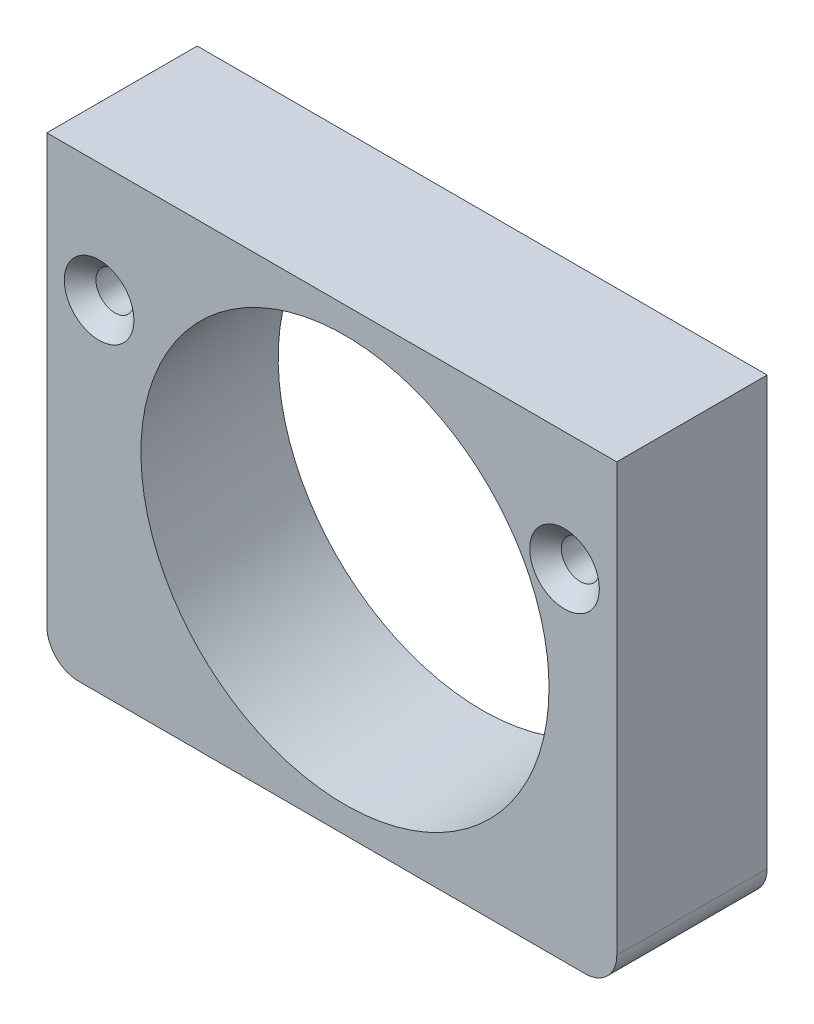
ISO-10303-21;
HEADER;
FILE_DESCRIPTION(('STEP AP214'),'2;1');
FILE_NAME('part.step','',(''),(''),'','','');
FILE_SCHEMA(('AUTOMOTIVE_DESIGN { 1 0 10303 214 1 1 1 1 }'));
ENDSEC;
DATA;
#1=APPLICATION_CONTEXT('core data for automotive mechanical design processes');
#2=APPLICATION_PROTOCOL_DEFINITION('international standard','automotive_design',2000,#1);
#3=PRODUCT_CONTEXT('',#1,'mechanical');
#4=PRODUCT('Part','Part','',(#3));
#5=PRODUCT_RELATED_PRODUCT_CATEGORY('part','',(#4));
#6=PRODUCT_DEFINITION_FORMATION('','',#4);
#7=PRODUCT_DEFINITION_CONTEXT('part definition',#1,'design');
#8=PRODUCT_DEFINITION('design','',#6,#7);
#9=PRODUCT_DEFINITION_SHAPE('','',#8);
#10=(LENGTH_UNIT() NAMED_UNIT(*) SI_UNIT(.MILLI.,.METRE.));
#11=(NAMED_UNIT(*) PLANE_ANGLE_UNIT() SI_UNIT($,.RADIAN.));
#12=(NAMED_UNIT(*) SI_UNIT($,.STERADIAN.) SOLID_ANGLE_UNIT());
#13=UNCERTAINTY_MEASURE_WITH_UNIT(LENGTH_MEASURE(1.E-05),#10,'distance_accuracy_value','');
#14=(GEOMETRIC_REPRESENTATION_CONTEXT(3) GLOBAL_UNCERTAINTY_ASSIGNED_CONTEXT((#13)) GLOBAL_UNIT_ASSIGNED_CONTEXT((#10,
#11,#12)) REPRESENTATION_CONTEXT('',''));
#15=CARTESIAN_POINT('',(0.,0.,0.));
#16=DIRECTION('',(0.,0.,1.));
#17=DIRECTION('',(1.,0.,0.));
#18=AXIS2_PLACEMENT_3D('',#15,#16,#17);
#19=CARTESIAN_POINT('',(-16.,-12.5,9.5));
#20=DIRECTION('',(0.,0.,-1.));
#21=DIRECTION('',(-1.,0.,0.));
#22=AXIS2_PLACEMENT_3D('',#19,#20,#21);
#23=PLANE('',#22);
#24=CARTESIAN_POINT('',(0.83114230349628,0.,9.5));
#25=DIRECTION('',(0.,0.,-1.));
#26=DIRECTION('',(1.,0.,0.));
#27=AXIS2_PLACEMENT_3D('',#24,#25,#26);
#28=ELLIPSE('',#27,12.8887455681053,12.8397);
#29=CARTESIAN_POINT('',(13.7198878716016,0.,9.5));
#30=VERTEX_POINT('',#29);
#31=EDGE_CURVE('E121',#30,#30,#28,.F.);
#32=ORIENTED_EDGE('',*,*,#31,.F.);
#33=EDGE_LOOP('',(#32));
#34=FACE_BOUND('',#33,.T.);
#35=DIRECTION('',(0.,1.,0.));
#36=VECTOR('',#35,1.);
#37=CARTESIAN_POINT('',(18.,-12.5,9.5));
#38=LINE('',#37,#36);
#39=CARTESIAN_POINT('',(18.,-12.5,9.5));
#40=VERTEX_POINT('',#39);
#41=CARTESIAN_POINT('',(18.,14.5,9.5));
#42=VERTEX_POINT('',#41);
#43=EDGE_CURVE('E128',#40,#42,#38,.T.);
#44=ORIENTED_EDGE('',*,*,#43,.T.);
#45=DIRECTION('',(-1.,0.,0.));
#46=VECTOR('',#45,1.);
#47=CARTESIAN_POINT('',(-18.,14.5,9.5));
#48=LINE('',#47,#46);
#49=CARTESIAN_POINT('',(-18.,14.5,9.5));
#50=VERTEX_POINT('',#49);
#51=EDGE_CURVE('E86',#42,#50,#48,.T.);
#52=ORIENTED_EDGE('',*,*,#51,.T.);
#53=DIRECTION('',(0.,-1.,0.));
#54=VECTOR('',#53,1.);
#55=CARTESIAN_POINT('',(-18.,-12.5,9.5));
#56=LINE('',#55,#54);
#57=CARTESIAN_POINT('',(-18.,-12.5,9.5));
#58=VERTEX_POINT('',#57);
#59=EDGE_CURVE('E99',#50,#58,#56,.T.);
#60=ORIENTED_EDGE('',*,*,#59,.T.);
#61=CARTESIAN_POINT('',(-16.,-12.5,9.5));
#62=DIRECTION('',(0.,0.,1.));
#63=DIRECTION('',(-1.,0.,0.));
#64=AXIS2_PLACEMENT_3D('',#61,#62,#63);
#65=CIRCLE('',#64,2.);
#66=CARTESIAN_POINT('',(-16.,-14.5,9.5));
#67=VERTEX_POINT('',#66);
#68=EDGE_CURVE('E93',#58,#67,#65,.T.);
#69=ORIENTED_EDGE('',*,*,#68,.T.);
#70=DIRECTION('',(1.,0.,0.));
#71=VECTOR('',#70,1.);
#72=CARTESIAN_POINT('',(-16.,-14.5,9.5));
#73=LINE('',#72,#71);
#74=CARTESIAN_POINT('',(16.,-14.5,9.5));
#75=VERTEX_POINT('',#74);
#76=EDGE_CURVE('E97',#67,#75,#73,.T.);
#77=ORIENTED_EDGE('',*,*,#76,.T.);
#78=CARTESIAN_POINT('',(16.,-12.5,9.5));
#79=DIRECTION('',(0.,0.,1.));
#80=DIRECTION('',(1.,0.,0.));
#81=AXIS2_PLACEMENT_3D('',#78,#79,#80);
#82=CIRCLE('',#81,2.);
#83=EDGE_CURVE('E49',#75,#40,#82,.T.);
#84=ORIENTED_EDGE('',*,*,#83,.T.);
#85=EDGE_LOOP('',(#44,#52,#60,#69,#77,#84));
#86=FACE_BOUND('',#85,.T.);
#87=CARTESIAN_POINT('',(14.7,7.,9.5));
#88=DIRECTION('',(0.,0.,1.));
#89=DIRECTION('',(1.,0.,0.));
#90=AXIS2_PLACEMENT_3D('',#87,#88,#89);
#91=CIRCLE('',#90,2.2);
#92=CARTESIAN_POINT('',(16.9,7.,9.5));
#93=VERTEX_POINT('',#92);
#94=EDGE_CURVE('E195',#93,#93,#91,.T.);
#95=ORIENTED_EDGE('',*,*,#94,.F.);
#96=EDGE_LOOP('',(#95));
#97=FACE_BOUND('',#96,.T.);
#98=CARTESIAN_POINT('',(-14.7,7.,9.5));
#99=DIRECTION('',(0.,0.,1.));
#100=DIRECTION('',(1.,0.,0.));
#101=AXIS2_PLACEMENT_3D('',#98,#99,#100);
#102=CIRCLE('',#101,2.2);
#103=CARTESIAN_POINT('',(-12.5,7.,9.5));
#104=VERTEX_POINT('',#103);
#105=EDGE_CURVE('E187',#104,#104,#102,.T.);
#106=ORIENTED_EDGE('',*,*,#105,.F.);
#107=EDGE_LOOP('',(#106));
#108=FACE_BOUND('',#107,.T.);
#109=ADVANCED_FACE('F32',(#34,#86,#97,#108),#23,.F.);
#110=CARTESIAN_POINT('',(18.,-12.5,9.5));
#111=DIRECTION('',(-1.,0.,0.));
#112=DIRECTION('',(0.,-1.,0.));
#113=AXIS2_PLACEMENT_3D('',#110,#111,#112);
#114=PLANE('',#113);
#115=DIRECTION('',(0.,1.,0.));
#116=VECTOR('',#115,1.);
#117=CARTESIAN_POINT('',(18.,-12.5,0.));
#118=LINE('',#117,#116);
#119=CARTESIAN_POINT('',(18.,-12.5,0.));
#120=VERTEX_POINT('',#119);
#121=CARTESIAN_POINT('',(18.,14.5,0.));
#122=VERTEX_POINT('',#121);
#123=EDGE_CURVE('E117',#120,#122,#118,.T.);
#124=ORIENTED_EDGE('',*,*,#123,.T.);
#125=DIRECTION('',(0.,0.,-1.));
#126=VECTOR('',#125,1.);
#127=CARTESIAN_POINT('',(18.,14.5,9.5));
#128=LINE('',#127,#126);
#129=EDGE_CURVE('E11',#42,#122,#128,.T.);
#130=ORIENTED_EDGE('',*,*,#129,.F.);
#131=ORIENTED_EDGE('',*,*,#43,.F.);
#132=DIRECTION('',(0.,0.,-1.));
#133=VECTOR('',#132,1.);
#134=CARTESIAN_POINT('',(18.,-12.5,9.5));
#135=LINE('',#134,#133);
#136=EDGE_CURVE('E113',#40,#120,#135,.T.);
#137=ORIENTED_EDGE('',*,*,#136,.T.);
#138=EDGE_LOOP('',(#124,#130,#131,#137));
#139=FACE_BOUND('',#138,.T.);
#140=ADVANCED_FACE('F34',(#139),#114,.F.);
#141=CARTESIAN_POINT('',(-18.,14.5,9.5));
#142=DIRECTION('',(0.,-1.,0.));
#143=DIRECTION('',(0.,0.,-1.));
#144=AXIS2_PLACEMENT_3D('',#141,#142,#143);
#145=PLANE('',#144);
#146=DIRECTION('',(-1.,0.,0.));
#147=VECTOR('',#146,1.);
#148=CARTESIAN_POINT('',(-18.,14.5,0.));
#149=LINE('',#148,#147);
#150=CARTESIAN_POINT('',(-18.,14.5,0.));
#151=VERTEX_POINT('',#150);
#152=EDGE_CURVE('E120',#122,#151,#149,.T.);
#153=ORIENTED_EDGE('',*,*,#152,.T.);
#154=DIRECTION('',(0.,0.,-1.));
#155=VECTOR('',#154,1.);
#156=CARTESIAN_POINT('',(-18.,14.5,9.5));
#157=LINE('',#156,#155);
#158=EDGE_CURVE('E41',#50,#151,#157,.T.);
#159=ORIENTED_EDGE('',*,*,#158,.F.);
#160=ORIENTED_EDGE('',*,*,#51,.F.);
#161=ORIENTED_EDGE('',*,*,#129,.T.);
#162=EDGE_LOOP('',(#153,#159,#160,#161));
#163=FACE_BOUND('',#162,.T.);
#164=ADVANCED_FACE('F158',(#163),#145,.F.);
#165=CARTESIAN_POINT('',(-18.,-12.5,9.5));
#166=DIRECTION('',(1.,0.,0.));
#167=DIRECTION('',(0.,1.,0.));
#168=AXIS2_PLACEMENT_3D('',#165,#166,#167);
#169=PLANE('',#168);
#170=DIRECTION('',(0.,-1.,0.));
#171=VECTOR('',#170,1.);
#172=CARTESIAN_POINT('',(-18.,-12.5,0.));
#173=LINE('',#172,#171);
#174=CARTESIAN_POINT('',(-18.,-12.5,0.));
#175=VERTEX_POINT('',#174);
#176=EDGE_CURVE('E123',#151,#175,#173,.T.);
#177=ORIENTED_EDGE('',*,*,#176,.T.);
#178=DIRECTION('',(0.,0.,-1.));
#179=VECTOR('',#178,1.);
#180=CARTESIAN_POINT('',(-18.,-12.5,9.5));
#181=LINE('',#180,#179);
#182=EDGE_CURVE('E108',#58,#175,#181,.T.);
#183=ORIENTED_EDGE('',*,*,#182,.F.);
#184=ORIENTED_EDGE('',*,*,#59,.F.);
#185=ORIENTED_EDGE('',*,*,#158,.T.);
#186=EDGE_LOOP('',(#177,#183,#184,#185));
#187=FACE_BOUND('',#186,.T.);
#188=ADVANCED_FACE('F134',(#187),#169,.F.);
#189=CARTESIAN_POINT('',(-16.,-12.5,9.5));
#190=DIRECTION('',(0.,0.,-1.));
#191=DIRECTION('',(-1.,0.,0.));
#192=AXIS2_PLACEMENT_3D('',#189,#190,#191);
#193=CYLINDRICAL_SURFACE('',#192,2.);
#194=CARTESIAN_POINT('',(-16.,-12.5,0.));
#195=DIRECTION('',(0.,0.,1.));
#196=DIRECTION('',(-1.,0.,0.));
#197=AXIS2_PLACEMENT_3D('',#194,#195,#196);
#198=CIRCLE('',#197,2.);
#199=CARTESIAN_POINT('',(-16.,-14.5,0.));
#200=VERTEX_POINT('',#199);
#201=EDGE_CURVE('E107',#175,#200,#198,.T.);
#202=ORIENTED_EDGE('',*,*,#201,.T.);
#203=DIRECTION('',(0.,0.,-1.));
#204=VECTOR('',#203,1.);
#205=CARTESIAN_POINT('',(-16.,-14.5,9.5));
#206=LINE('',#205,#204);
#207=EDGE_CURVE('E104',#67,#200,#206,.T.);
#208=ORIENTED_EDGE('',*,*,#207,.F.);
#209=ORIENTED_EDGE('',*,*,#68,.F.);
#210=ORIENTED_EDGE('',*,*,#182,.T.);
#211=EDGE_LOOP('',(#202,#208,#209,#210));
#212=FACE_BOUND('',#211,.T.);
#213=ADVANCED_FACE('F105',(#212),#193,.T.);
#214=CARTESIAN_POINT('',(-16.,-14.5,9.5));
#215=DIRECTION('',(0.,1.,0.));
#216=DIRECTION('',(0.,0.,1.));
#217=AXIS2_PLACEMENT_3D('',#214,#215,#216);
#218=PLANE('',#217);
#219=DIRECTION('',(1.,0.,0.));
#220=VECTOR('',#219,1.);
#221=CARTESIAN_POINT('',(-16.,-14.5,0.));
#222=LINE('',#221,#220);
#223=CARTESIAN_POINT('',(16.,-14.5,0.));
#224=VERTEX_POINT('',#223);
#225=EDGE_CURVE('E72',#200,#224,#222,.T.);
#226=ORIENTED_EDGE('',*,*,#225,.T.);
#227=DIRECTION('',(0.,0.,-1.));
#228=VECTOR('',#227,1.);
#229=CARTESIAN_POINT('',(16.,-14.5,9.5));
#230=LINE('',#229,#228);
#231=EDGE_CURVE('E109',#75,#224,#230,.T.);
#232=ORIENTED_EDGE('',*,*,#231,.F.);
#233=ORIENTED_EDGE('',*,*,#76,.F.);
#234=ORIENTED_EDGE('',*,*,#207,.T.);
#235=EDGE_LOOP('',(#226,#232,#233,#234));
#236=FACE_BOUND('',#235,.T.);
#237=ADVANCED_FACE('F111',(#236),#218,.F.);
#238=CARTESIAN_POINT('',(16.,-12.5,9.5));
#239=DIRECTION('',(0.,0.,-1.));
#240=DIRECTION('',(-1.,0.,0.));
#241=AXIS2_PLACEMENT_3D('',#238,#239,#240);
#242=CYLINDRICAL_SURFACE('',#241,2.);
#243=CARTESIAN_POINT('',(16.,-12.5,0.));
#244=DIRECTION('',(0.,0.,1.));
#245=DIRECTION('',(1.,0.,0.));
#246=AXIS2_PLACEMENT_3D('',#243,#244,#245);
#247=CIRCLE('',#246,2.);
#248=EDGE_CURVE('E78',#224,#120,#247,.T.);
#249=ORIENTED_EDGE('',*,*,#248,.T.);
#250=ORIENTED_EDGE('',*,*,#136,.F.);
#251=ORIENTED_EDGE('',*,*,#83,.F.);
#252=ORIENTED_EDGE('',*,*,#231,.T.);
#253=EDGE_LOOP('',(#249,#250,#251,#252));
#254=FACE_BOUND('',#253,.T.);
#255=ADVANCED_FACE('F141',(#254),#242,.T.);
#256=CARTESIAN_POINT('',(-16.,-12.5,0.));
#257=DIRECTION('',(0.,0.,-1.));
#258=DIRECTION('',(-1.,0.,0.));
#259=AXIS2_PLACEMENT_3D('',#256,#257,#258);
#260=PLANE('',#259);
#261=CARTESIAN_POINT('',(-14.7,7.,0.));
#262=DIRECTION('',(0.,0.,-1.));
#263=DIRECTION('',(-1.,0.,0.));
#264=AXIS2_PLACEMENT_3D('',#261,#262,#263);
#265=CIRCLE('',#264,1.2);
#266=CARTESIAN_POINT('',(-15.9,7.,0.));
#267=VERTEX_POINT('',#266);
#268=EDGE_CURVE('E190',#267,#267,#265,.T.);
#269=ORIENTED_EDGE('',*,*,#268,.F.);
#270=EDGE_LOOP('',(#269));
#271=FACE_BOUND('',#270,.T.);
#272=CARTESIAN_POINT('',(14.7,7.,0.));
#273=DIRECTION('',(0.,0.,-1.));
#274=DIRECTION('',(-1.,0.,0.));
#275=AXIS2_PLACEMENT_3D('',#272,#273,#274);
#276=CIRCLE('',#275,1.2);
#277=CARTESIAN_POINT('',(13.5,7.,0.));
#278=VERTEX_POINT('',#277);
#279=EDGE_CURVE('E201',#278,#278,#276,.T.);
#280=ORIENTED_EDGE('',*,*,#279,.F.);
#281=EDGE_LOOP('',(#280));
#282=FACE_BOUND('',#281,.T.);
#283=CARTESIAN_POINT('',(0.,0.,0.));
#284=DIRECTION('',(0.,0.,-1.));
#285=DIRECTION('',(1.,0.,0.));
#286=AXIS2_PLACEMENT_3D('',#283,#284,#285);
#287=ELLIPSE('',#286,12.8887455681053,12.8397);
#288=CARTESIAN_POINT('',(12.8887455681053,0.,0.));
#289=VERTEX_POINT('',#288);
#290=EDGE_CURVE('E204',#289,#289,#287,.F.);
#291=ORIENTED_EDGE('',*,*,#290,.T.);
#292=EDGE_LOOP('',(#291));
#293=FACE_BOUND('',#292,.T.);
#294=ORIENTED_EDGE('',*,*,#123,.F.);
#295=ORIENTED_EDGE('',*,*,#248,.F.);
#296=ORIENTED_EDGE('',*,*,#225,.F.);
#297=ORIENTED_EDGE('',*,*,#201,.F.);
#298=ORIENTED_EDGE('',*,*,#176,.F.);
#299=ORIENTED_EDGE('',*,*,#152,.F.);
#300=EDGE_LOOP('',(#294,#295,#296,#297,#298,#299));
#301=FACE_BOUND('',#300,.T.);
#302=ADVANCED_FACE('F137',(#271,#282,#293,#301),#260,.T.);
#303=CARTESIAN_POINT('',(-0.136824643102456,0.,-1.56391282696772));
#304=DIRECTION('',(0.0871557427476584,0.,0.996194698091746));
#305=DIRECTION('',(0.996194698091746,0.,-0.0871557427476584));
#306=AXIS2_PLACEMENT_3D('',#303,#304,#305);
#307=CYLINDRICAL_SURFACE('',#306,12.8397);
#308=ORIENTED_EDGE('',*,*,#290,.F.);
#309=EDGE_LOOP('',(#308));
#310=FACE_BOUND('',#309,.T.);
#311=ORIENTED_EDGE('',*,*,#31,.T.);
#312=EDGE_LOOP('',(#311));
#313=FACE_BOUND('',#312,.T.);
#314=ADVANCED_FACE('F148',(#310,#313),#307,.F.);
#315=CARTESIAN_POINT('',(14.7,7.,9.5));
#316=DIRECTION('',(0.,0.,1.));
#317=DIRECTION('',(1.,0.,0.));
#318=AXIS2_PLACEMENT_3D('',#315,#316,#317);
#319=CYLINDRICAL_SURFACE('',#318,1.2);
#320=CARTESIAN_POINT('',(14.7,7.,8.5));
#321=DIRECTION('',(0.,0.,1.));
#322=DIRECTION('',(1.,0.,0.));
#323=AXIS2_PLACEMENT_3D('',#320,#321,#322);
#324=CIRCLE('',#323,1.2);
#325=CARTESIAN_POINT('',(15.9,7.,8.5));
#326=VERTEX_POINT('',#325);
#327=EDGE_CURVE('E198',#326,#326,#324,.T.);
#328=ORIENTED_EDGE('',*,*,#327,.T.);
#329=EDGE_LOOP('',(#328));
#330=FACE_BOUND('',#329,.T.);
#331=ORIENTED_EDGE('',*,*,#279,.T.);
#332=EDGE_LOOP('',(#331));
#333=FACE_BOUND('',#332,.T.);
#334=ADVANCED_FACE('F163',(#330,#333),#319,.F.);
#335=CARTESIAN_POINT('',(14.7,7.,9.5));
#336=DIRECTION('',(0.,0.,1.));
#337=DIRECTION('',(1.,0.,0.));
#338=AXIS2_PLACEMENT_3D('',#335,#336,#337);
#339=CONICAL_SURFACE('',#338,2.2,0.785398163397447);
#340=ORIENTED_EDGE('',*,*,#327,.F.);
#341=EDGE_LOOP('',(#340));
#342=FACE_BOUND('',#341,.T.);
#343=ORIENTED_EDGE('',*,*,#94,.T.);
#344=EDGE_LOOP('',(#343));
#345=FACE_BOUND('',#344,.T.);
#346=ADVANCED_FACE('F167',(#342,#345),#339,.F.);
#347=CARTESIAN_POINT('',(-14.7,7.,9.5));
#348=DIRECTION('',(0.,0.,1.));
#349=DIRECTION('',(1.,0.,0.));
#350=AXIS2_PLACEMENT_3D('',#347,#348,#349);
#351=CYLINDRICAL_SURFACE('',#350,1.2);
#352=CARTESIAN_POINT('',(-14.7,7.,8.5));
#353=DIRECTION('',(0.,0.,1.));
#354=DIRECTION('',(1.,0.,0.));
#355=AXIS2_PLACEMENT_3D('',#352,#353,#354);
#356=CIRCLE('',#355,1.2);
#357=CARTESIAN_POINT('',(-13.5,7.,8.5));
#358=VERTEX_POINT('',#357);
#359=EDGE_CURVE('E184',#358,#358,#356,.T.);
#360=ORIENTED_EDGE('',*,*,#359,.T.);
#361=EDGE_LOOP('',(#360));
#362=FACE_BOUND('',#361,.T.);
#363=ORIENTED_EDGE('',*,*,#268,.T.);
#364=EDGE_LOOP('',(#363));
#365=FACE_BOUND('',#364,.T.);
#366=ADVANCED_FACE('F171',(#362,#365),#351,.F.);
#367=CARTESIAN_POINT('',(-14.7,7.,9.5));
#368=DIRECTION('',(0.,0.,1.));
#369=DIRECTION('',(1.,0.,0.));
#370=AXIS2_PLACEMENT_3D('',#367,#368,#369);
#371=CONICAL_SURFACE('',#370,2.2,0.785398163397447);
#372=ORIENTED_EDGE('',*,*,#359,.F.);
#373=EDGE_LOOP('',(#372));
#374=FACE_BOUND('',#373,.T.);
#375=ORIENTED_EDGE('',*,*,#105,.T.);
#376=EDGE_LOOP('',(#375));
#377=FACE_BOUND('',#376,.T.);
#378=ADVANCED_FACE('F175',(#374,#377),#371,.F.);
#379=CLOSED_SHELL('',(#109,#140,#164,#188,#213,#237,#255,#302,#314,#334,#346,#366,#378));
#380=MANIFOLD_SOLID_BREP('B2',#379);
#381=ADVANCED_BREP_SHAPE_REPRESENTATION('',(#18,#380),#14);
#382=SHAPE_DEFINITION_REPRESENTATION(#9,#381);
ENDSEC;
END-ISO-10303-21;
